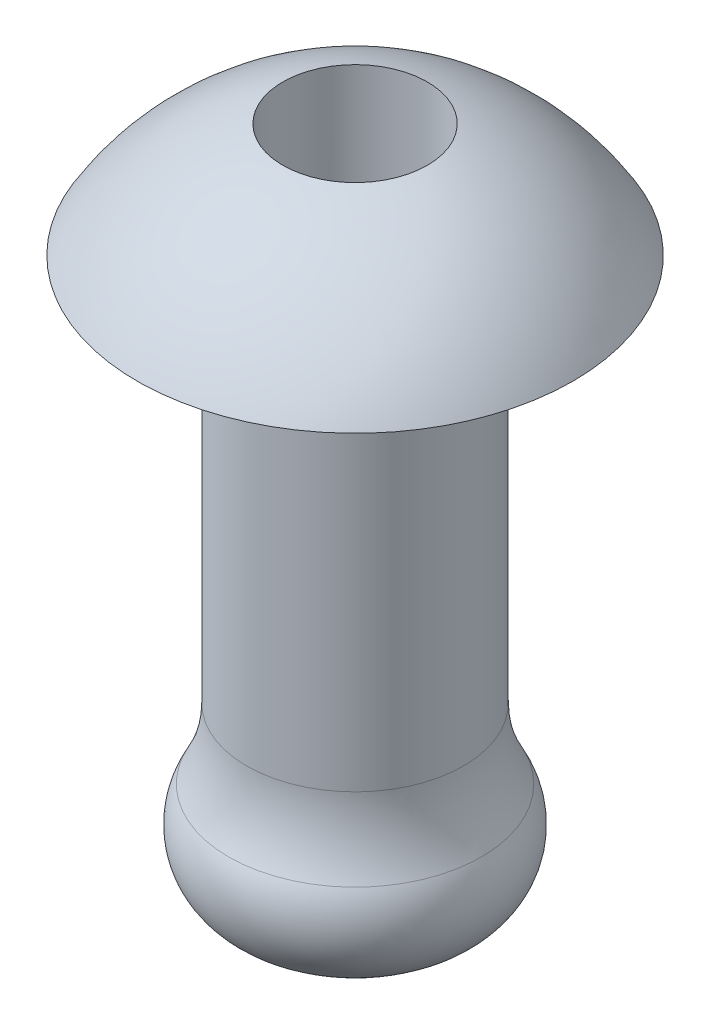
ISO-10303-21;
HEADER;
FILE_DESCRIPTION(('STEP AP214'),'2;1');
FILE_NAME('part.step','',(''),(''),'','','');
FILE_SCHEMA(('AUTOMOTIVE_DESIGN { 1 0 10303 214 1 1 1 1 }'));
ENDSEC;
DATA;
#1=APPLICATION_CONTEXT('core data for automotive mechanical design processes');
#2=APPLICATION_PROTOCOL_DEFINITION('international standard','automotive_design',2000,#1);
#3=PRODUCT_CONTEXT('',#1,'mechanical');
#4=PRODUCT('Part','Part','',(#3));
#5=PRODUCT_RELATED_PRODUCT_CATEGORY('part','',(#4));
#6=PRODUCT_DEFINITION_FORMATION('','',#4);
#7=PRODUCT_DEFINITION_CONTEXT('part definition',#1,'design');
#8=PRODUCT_DEFINITION('design','',#6,#7);
#9=PRODUCT_DEFINITION_SHAPE('','',#8);
#10=(LENGTH_UNIT() NAMED_UNIT(*) SI_UNIT(.MILLI.,.METRE.));
#11=(NAMED_UNIT(*) PLANE_ANGLE_UNIT() SI_UNIT($,.RADIAN.));
#12=(NAMED_UNIT(*) SI_UNIT($,.STERADIAN.) SOLID_ANGLE_UNIT());
#13=UNCERTAINTY_MEASURE_WITH_UNIT(LENGTH_MEASURE(1.E-05),#10,'distance_accuracy_value','');
#14=(GEOMETRIC_REPRESENTATION_CONTEXT(3) GLOBAL_UNCERTAINTY_ASSIGNED_CONTEXT((#13)) GLOBAL_UNIT_ASSIGNED_CONTEXT((#10,
#11,#12)) REPRESENTATION_CONTEXT('',''));
#15=CARTESIAN_POINT('',(0.,0.,0.));
#16=DIRECTION('',(0.,0.,1.));
#17=DIRECTION('',(1.,0.,0.));
#18=AXIS2_PLACEMENT_3D('',#15,#16,#17);
#19=CARTESIAN_POINT('',(-58.5541092274809,40.8717004303769,0.));
#20=DIRECTION('',(0.,1.,0.));
#21=DIRECTION('',(1.,0.,0.));
#22=AXIS2_PLACEMENT_3D('',#19,#20,#21);
#23=SPHERICAL_SURFACE('',#22,3.5);
#24=CARTESIAN_POINT('',(-58.5541092274809,42.6476405073017,0.));
#25=DIRECTION('',(0.,1.,0.));
#26=DIRECTION('',(0.,0.,1.));
#27=AXIS2_PLACEMENT_3D('',#24,#25,#26);
#28=CIRCLE('',#27,3.01596366741588);
#29=CARTESIAN_POINT('',(-55.538145560065,42.6476405073016,0.));
#30=VERTEX_POINT('',#29);
#31=EDGE_CURVE('E55',#30,#30,#28,.T.);
#32=CARTESIAN_POINT('',(-58.5541092274809,44.2258023966266,0.));
#33=DIRECTION('',(0.,-0.999999999999999,0.));
#34=DIRECTION('',(0.,0.,-1.));
#35=AXIS2_PLACEMENT_3D('',#32,#33,#34);
#36=CIRCLE('',#35,0.999999999999998);
#37=CARTESIAN_POINT('',(-57.5541092274809,44.2258023966266,0.));
#38=VERTEX_POINT('',#37);
#39=EDGE_CURVE('E59',#38,#38,#36,.F.);
#40=CARTESIAN_POINT('',(-55.538145560065,42.6476405073016,0.));
#41=CARTESIAN_POINT('',(-55.5519990692972,42.6711671458969,0.));
#42=CARTESIAN_POINT('',(-55.5661279692771,42.6945316186199,0.));
#43=CARTESIAN_POINT('',(-55.5949285788495,42.7409235827264,0.));
#44=CARTESIAN_POINT('',(-55.6096002884421,42.7639510741098,0.));
#45=CARTESIAN_POINT('',(-55.6394785453569,42.8096564259417,0.));
#46=CARTESIAN_POINT('',(-55.6546850926791,42.8323342863902,0.));
#47=CARTESIAN_POINT('',(-55.6856246806254,42.8773279676739,0.));
#48=CARTESIAN_POINT('',(-55.7013577212495,42.8996437885092,0.));
#49=CARTESIAN_POINT('',(-55.733341684389,42.9439011669034,0.));
#50=CARTESIAN_POINT('',(-55.7495926069045,42.9658427244623,0.));
#51=CARTESIAN_POINT('',(-55.7826034330891,43.0093395611493,0.));
#52=CARTESIAN_POINT('',(-55.7993633367582,43.0308948402775,0.));
#53=CARTESIAN_POINT('',(-55.8333829473101,43.0736073155359,0.));
#54=CARTESIAN_POINT('',(-55.8506426541929,43.0947645116662,0.));
#55=CARTESIAN_POINT('',(-55.8856524191131,43.1366692346198,0.));
#56=CARTESIAN_POINT('',(-55.9034024771506,43.1574167614432,0.));
#57=CARTESIAN_POINT('',(-55.9393832238992,43.1984907837535,0.));
#58=CARTESIAN_POINT('',(-55.9576139126103,43.2188172792406,0.));
#59=CARTESIAN_POINT('',(-55.9945459369869,43.2590381074377,0.));
#60=CARTESIAN_POINT('',(-56.0132472726524,43.2789324401478,0.));
#61=CARTESIAN_POINT('',(-56.0511103494847,43.3182780480117,0.));
#62=CARTESIAN_POINT('',(-56.0702720906515,43.3377293231656,0.));
#63=CARTESIAN_POINT('',(-56.1090454848986,43.3761781637718,0.));
#64=CARTESIAN_POINT('',(-56.1286571379789,43.3951757292241,0.));
#65=CARTESIAN_POINT('',(-56.1683196160793,43.4327067467474,0.));
#66=CARTESIAN_POINT('',(-56.1883704410994,43.4512401988184,0.));
#67=CARTESIAN_POINT('',(-56.2289002826008,43.4878328400632,0.));
#68=CARTESIAN_POINT('',(-56.2493792990822,43.5058920292369,0.));
#69=CARTESIAN_POINT('',(-56.2907543085362,43.5415262548925,0.));
#70=CARTESIAN_POINT('',(-56.3116503015089,43.5591012913744,0.));
#71=CARTESIAN_POINT('',(-56.353847820626,43.5937575869896,0.));
#72=CARTESIAN_POINT('',(-56.3751493467703,43.6108388461228,0.));
#73=CARTESIAN_POINT('',(-56.4181462668278,43.6444982327923,0.));
#74=CARTESIAN_POINT('',(-56.439841660741,43.6610763603285,0.));
#75=CARTESIAN_POINT('',(-56.4836144352389,43.6937204050865,0.));
#76=CARTESIAN_POINT('',(-56.5056918158235,43.7097863223083,0.));
#77=CARTESIAN_POINT('',(-56.5502164733784,43.7413971482231,0.));
#78=CARTESIAN_POINT('',(-56.5726637503488,43.756942056916,0.));
#79=CARTESIAN_POINT('',(-56.6179159078223,43.7875023528797,0.));
#80=CARTESIAN_POINT('',(-56.6407207883255,43.8025177401504,0.));
#81=CARTESIAN_POINT('',(-56.6866756641767,43.8320107703593,0.));
#82=CARTESIAN_POINT('',(-56.7098256595247,43.8464884132974,0.));
#83=CARTESIAN_POINT('',(-56.7564580873813,43.8748980264169,0.));
#84=CARTESIAN_POINT('',(-56.7799405198899,43.8888299965983,0.));
#85=CARTESIAN_POINT('',(-56.8272249623305,43.9161406346076,0.));
#86=CARTESIAN_POINT('',(-56.8510269722624,43.9295193024356,0.));
#87=CARTESIAN_POINT('',(-56.8989375348008,43.95571600915,0.));
#88=CARTESIAN_POINT('',(-56.9230460874071,43.9685340480363,0.));
#89=CARTESIAN_POINT('',(-56.9715565326756,43.993602477289,0.));
#90=CARTESIAN_POINT('',(-56.9959584253376,44.0058528676554,0.));
#91=CARTESIAN_POINT('',(-57.0450421874455,44.0297792911851,0.));
#92=CARTESIAN_POINT('',(-57.0697240568914,44.0414553243485,0.));
#93=CARTESIAN_POINT('',(-57.1193542560105,44.0642266392029,0.));
#94=CARTESIAN_POINT('',(-57.1443025856839,44.0753219208939,0.));
#95=CARTESIAN_POINT('',(-57.1944520426306,44.0969256570319,0.));
#96=CARTESIAN_POINT('',(-57.2196531699039,44.1074341114789,0.));
#97=CARTESIAN_POINT('',(-57.2702944215389,44.1278584370072,0.));
#98=CARTESIAN_POINT('',(-57.2957345459004,44.1377743080885,0.));
#99=CARTESIAN_POINT('',(-57.3468398582436,44.1570080416848,0.));
#100=CARTESIAN_POINT('',(-57.3725050462252,44.1663259041999,0.));
#101=CARTESIAN_POINT('',(-57.4240464368273,44.1843584990534,0.));
#102=CARTESIAN_POINT('',(-57.4499226394477,44.1930732313918,0.));
#103=CARTESIAN_POINT('',(-57.5018718659062,44.2098948637668,0.));
#104=CARTESIAN_POINT('',(-57.5279448897444,44.2180017638034,0.));
#105=CARTESIAN_POINT('',(-57.5541092274809,44.2258023966266,0.));
#106=B_SPLINE_CURVE_WITH_KNOTS('',3,(#40,#41,#42,#43,#44,#45,#46,#47,#48,#49,#50,#51,#52,#53,
#54,#55,#56,#57,#58,#59,#60,#61,#62,#63,#64,#65,#66,#67,#68,#69,#70,#71,#72,#73,#74,#75,#76,#77,
#78,#79,#80,#81,#82,#83,#84,#85,#86,#87,#88,#89,#90,#91,#92,#93,#94,#95,#96,#97,#98,#99,#100,
#101,#102,#103,#104,#105),.UNSPECIFIED.,.F.,.F.,(4,2,2,2,2,2,2,2,2,2,2,2,2,2,2,2,2,2,2,2,2,2,2,
2,2,2,2,2,2,2,2,2,4),(0.,0.0819054033817423,0.163810806763483,0.245716210145222,
0.327621613526962,0.409527016908704,0.491432420290441,0.573337823672186,0.655243227053923,
0.737148630435665,0.819054033817408,0.900959437199148,0.982864840580892,1.06477024396263,
1.14667564734437,1.22858105072611,1.31048645410785,1.39239185748959,1.47429726087133,
1.55620266425307,1.63810806763481,1.72001347101655,1.80191887439829,1.88382427778003,
1.96572968116177,2.04763508454352,2.12954048792525,2.21144589130699,2.29335129468874,
2.37525669807048,2.45716210145221,2.53906750483396,2.6209729082157),.UNSPECIFIED.);
#107=EDGE_CURVE('BSEAM39',#30,#38,#106,.T.);
#108=ORIENTED_EDGE('',*,*,#31,.T.);
#109=ORIENTED_EDGE('',*,*,#39,.F.);
#110=ORIENTED_EDGE('',*,*,#107,.T.);
#111=ORIENTED_EDGE('',*,*,#107,.F.);
#112=EDGE_LOOP('',(#108,#110,#109,#111));
#113=FACE_BOUND('',#112,.T.);
#114=ADVANCED_FACE('F39',(#113),#23,.T.);
#115=CARTESIAN_POINT('',(-58.5541092274809,37.2781572093375,0.));
#116=DIRECTION('',(0.,1.,0.));
#117=DIRECTION('',(0.,0.,1.));
#118=AXIS2_PLACEMENT_3D('',#115,#116,#117);
#119=TOROIDAL_SURFACE('',#118,3.50000000000001,2.00000000000001);
#120=CARTESIAN_POINT('',(-58.5541092274809,36.3122169535868,0.));
#121=DIRECTION('',(0.,1.,0.));
#122=DIRECTION('',(-1.,0.,0.));
#123=AXIS2_PLACEMENT_3D('',#120,#121,#122);
#124=CIRCLE('',#123,1.7487263428235);
#125=CARTESIAN_POINT('',(-60.3028355703044,36.3122169535868,0.));
#126=VERTEX_POINT('',#125);
#127=EDGE_CURVE('E10',#126,#126,#124,.T.);
#128=ORIENTED_EDGE('',*,*,#127,.T.);
#129=EDGE_LOOP('',(#128));
#130=FACE_BOUND('',#129,.T.);
#131=CARTESIAN_POINT('',(-58.5541092274809,37.2781572093375,0.));
#132=DIRECTION('',(0.,1.,0.));
#133=DIRECTION('',(0.,0.,1.));
#134=AXIS2_PLACEMENT_3D('',#131,#132,#133);
#135=CIRCLE('',#134,1.50000000000001);
#136=CARTESIAN_POINT('',(-58.5541092274809,37.2781572093375,1.50000000000001));
#137=VERTEX_POINT('',#136);
#138=EDGE_CURVE('E46',#137,#137,#135,.T.);
#139=ORIENTED_EDGE('',*,*,#138,.F.);
#140=EDGE_LOOP('',(#139));
#141=FACE_BOUND('',#140,.T.);
#142=ADVANCED_FACE('F75',(#130,#141),#119,.F.);
#143=CARTESIAN_POINT('',(-58.5541092274809,44.3717004303769,0.));
#144=DIRECTION('',(0.,1.,0.));
#145=DIRECTION('',(0.,0.,1.));
#146=AXIS2_PLACEMENT_3D('',#143,#144,#145);
#147=CYLINDRICAL_SURFACE('',#146,1.50000000000001);
#148=CARTESIAN_POINT('',(-58.5541092274809,42.6476405073017,0.));
#149=DIRECTION('',(0.,1.,0.));
#150=DIRECTION('',(0.,0.,1.));
#151=AXIS2_PLACEMENT_3D('',#148,#149,#150);
#152=CIRCLE('',#151,1.50000000000001);
#153=CARTESIAN_POINT('',(-58.5541092274809,42.6476405073017,1.50000000000001));
#154=VERTEX_POINT('',#153);
#155=EDGE_CURVE('E50',#154,#154,#152,.T.);
#156=ORIENTED_EDGE('',*,*,#155,.F.);
#157=EDGE_LOOP('',(#156));
#158=FACE_BOUND('',#157,.T.);
#159=ORIENTED_EDGE('',*,*,#138,.T.);
#160=EDGE_LOOP('',(#159));
#161=FACE_BOUND('',#160,.T.);
#162=ADVANCED_FACE('F81',(#158,#161),#147,.T.);
#163=CARTESIAN_POINT('',(0.,42.6476405073017,0.));
#164=DIRECTION('',(0.,1.,0.));
#165=DIRECTION('',(0.,0.,1.));
#166=AXIS2_PLACEMENT_3D('',#163,#164,#165);
#167=PLANE('',#166);
#168=ORIENTED_EDGE('',*,*,#31,.F.);
#169=EDGE_LOOP('',(#168));
#170=FACE_BOUND('',#169,.T.);
#171=ORIENTED_EDGE('',*,*,#155,.T.);
#172=EDGE_LOOP('',(#171));
#173=FACE_BOUND('',#172,.T.);
#174=ADVANCED_FACE('F70',(#170,#173),#167,.F.);
#175=CARTESIAN_POINT('',(-58.5541092274809,50.,0.));
#176=DIRECTION('',(0.,-1.,0.));
#177=DIRECTION('',(0.,0.,-1.));
#178=AXIS2_PLACEMENT_3D('',#175,#176,#177);
#179=CYLINDRICAL_SURFACE('',#178,0.999999999999998);
#180=CARTESIAN_POINT('',(-58.5541092274809,34.837332651701,0.));
#181=DIRECTION('',(0.,1.,0.));
#182=DIRECTION('',(0.,0.,1.));
#183=AXIS2_PLACEMENT_3D('',#180,#181,#182);
#184=CIRCLE('',#183,0.999999999999998);
#185=CARTESIAN_POINT('',(-58.5541092274809,34.837332651701,0.999999999999998));
#186=VERTEX_POINT('',#185);
#187=EDGE_CURVE('E61',#186,#186,#184,.T.);
#188=ORIENTED_EDGE('',*,*,#187,.F.);
#189=EDGE_LOOP('',(#188));
#190=FACE_BOUND('',#189,.T.);
#191=ORIENTED_EDGE('',*,*,#39,.T.);
#192=EDGE_LOOP('',(#191));
#193=FACE_BOUND('',#192,.T.);
#194=ADVANCED_FACE('F67',(#190,#193),#179,.F.);
#195=CARTESIAN_POINT('',(-58.5541092274809,35.8292468257115,0.));
#196=DIRECTION('',(0.,1.,0.));
#197=DIRECTION('',(-1.,0.,0.));
#198=AXIS2_PLACEMENT_3D('',#195,#196,#197);
#199=DEGENERATE_TOROIDAL_SURFACE('',#198,0.873089514235243,1.,.T.);
#200=ORIENTED_EDGE('',*,*,#187,.T.);
#201=EDGE_LOOP('',(#200));
#202=FACE_BOUND('',#201,.T.);
#203=ORIENTED_EDGE('',*,*,#127,.F.);
#204=EDGE_LOOP('',(#203));
#205=FACE_BOUND('',#204,.T.);
#206=ADVANCED_FACE('F41',(#202,#205),#199,.T.);
#207=CLOSED_SHELL('',(#114,#142,#162,#174,#194,#206));
#208=MANIFOLD_SOLID_BREP('B2',#207);
#209=ADVANCED_BREP_SHAPE_REPRESENTATION('',(#18,#208),#14);
#210=SHAPE_DEFINITION_REPRESENTATION(#9,#209);
ENDSEC;
END-ISO-10303-21;
